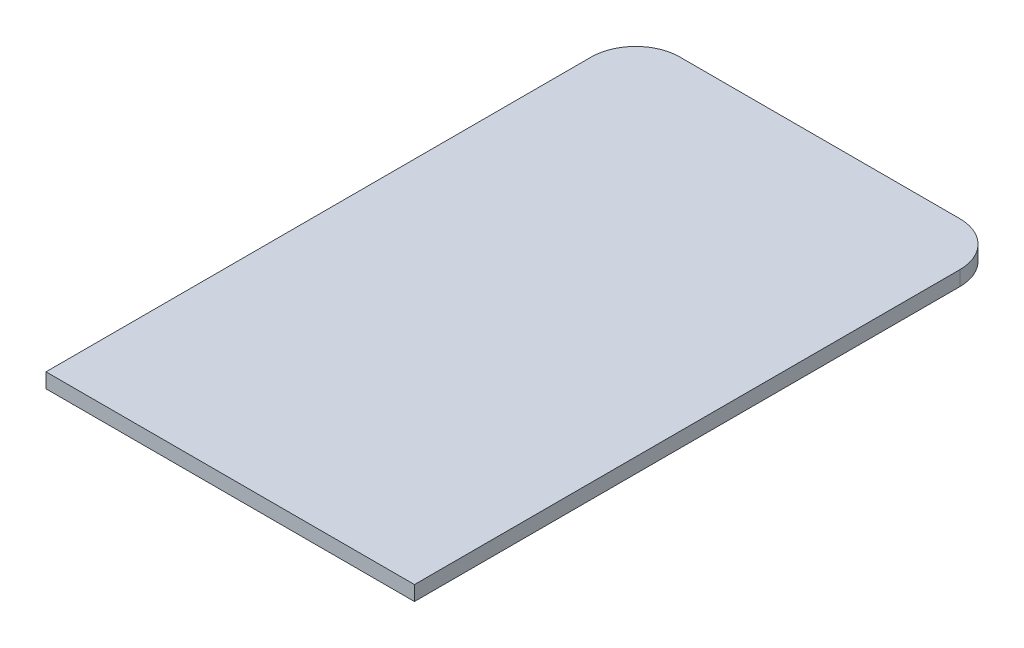
ISO-10303-21;
HEADER;
FILE_DESCRIPTION(('STEP AP214'),'2;1');
FILE_NAME('part.step','',(''),(''),'','','');
FILE_SCHEMA(('AUTOMOTIVE_DESIGN { 1 0 10303 214 1 1 1 1 }'));
ENDSEC;
DATA;
#1=APPLICATION_CONTEXT('core data for automotive mechanical design processes');
#2=APPLICATION_PROTOCOL_DEFINITION('international standard','automotive_design',2000,#1);
#3=PRODUCT_CONTEXT('',#1,'mechanical');
#4=PRODUCT('Part','Part','',(#3));
#5=PRODUCT_RELATED_PRODUCT_CATEGORY('part','',(#4));
#6=PRODUCT_DEFINITION_FORMATION('','',#4);
#7=PRODUCT_DEFINITION_CONTEXT('part definition',#1,'design');
#8=PRODUCT_DEFINITION('design','',#6,#7);
#9=PRODUCT_DEFINITION_SHAPE('','',#8);
#10=(LENGTH_UNIT() NAMED_UNIT(*) SI_UNIT(.MILLI.,.METRE.));
#11=(NAMED_UNIT(*) PLANE_ANGLE_UNIT() SI_UNIT($,.RADIAN.));
#12=(NAMED_UNIT(*) SI_UNIT($,.STERADIAN.) SOLID_ANGLE_UNIT());
#13=UNCERTAINTY_MEASURE_WITH_UNIT(LENGTH_MEASURE(1.E-05),#10,'distance_accuracy_value','');
#14=(GEOMETRIC_REPRESENTATION_CONTEXT(3) GLOBAL_UNCERTAINTY_ASSIGNED_CONTEXT((#13)) GLOBAL_UNIT_ASSIGNED_CONTEXT((#10,
#11,#12)) REPRESENTATION_CONTEXT('',''));
#15=CARTESIAN_POINT('',(0.,0.,0.));
#16=DIRECTION('',(0.,0.,1.));
#17=DIRECTION('',(1.,0.,0.));
#18=AXIS2_PLACEMENT_3D('',#15,#16,#17);
#19=CARTESIAN_POINT('',(0.,0.1,0.));
#20=DIRECTION('',(0.,0.,-1.));
#21=DIRECTION('',(-1.,0.,0.));
#22=AXIS2_PLACEMENT_3D('',#19,#20,#21);
#23=PLANE('',#22);
#24=DIRECTION('',(1.,0.,0.));
#25=VECTOR('',#24,1.);
#26=CARTESIAN_POINT('',(0.,0.,0.));
#27=LINE('',#26,#25);
#28=CARTESIAN_POINT('',(-1.25,0.,0.));
#29=VERTEX_POINT('',#28);
#30=CARTESIAN_POINT('',(1.25,0.,0.));
#31=VERTEX_POINT('',#30);
#32=EDGE_CURVE('E85',#29,#31,#27,.T.);
#33=ORIENTED_EDGE('',*,*,#32,.T.);
#34=DIRECTION('',(0.,-1.,0.));
#35=VECTOR('',#34,1.);
#36=CARTESIAN_POINT('',(1.25,0.1,0.));
#37=LINE('',#36,#35);
#38=CARTESIAN_POINT('',(1.25,0.1,0.));
#39=VERTEX_POINT('',#38);
#40=EDGE_CURVE('E11',#39,#31,#37,.T.);
#41=ORIENTED_EDGE('',*,*,#40,.F.);
#42=DIRECTION('',(1.,0.,0.));
#43=VECTOR('',#42,1.);
#44=CARTESIAN_POINT('',(-1.25,0.1,0.));
#45=LINE('',#44,#43);
#46=CARTESIAN_POINT('',(-1.25,0.1,0.));
#47=VERTEX_POINT('',#46);
#48=EDGE_CURVE('E91',#47,#39,#45,.T.);
#49=ORIENTED_EDGE('',*,*,#48,.F.);
#50=DIRECTION('',(0.,-1.,0.));
#51=VECTOR('',#50,1.);
#52=CARTESIAN_POINT('',(-1.25,0.1,0.));
#53=LINE('',#52,#51);
#54=EDGE_CURVE('E119',#47,#29,#53,.T.);
#55=ORIENTED_EDGE('',*,*,#54,.T.);
#56=EDGE_LOOP('',(#33,#41,#49,#55));
#57=FACE_BOUND('',#56,.T.);
#58=ADVANCED_FACE('F39',(#57),#23,.F.);
#59=CARTESIAN_POINT('',(1.25,0.1,0.));
#60=DIRECTION('',(-1.,0.,0.));
#61=DIRECTION('',(0.,0.,1.));
#62=AXIS2_PLACEMENT_3D('',#59,#60,#61);
#63=PLANE('',#62);
#64=DIRECTION('',(0.,0.,-1.));
#65=VECTOR('',#64,1.);
#66=CARTESIAN_POINT('',(1.25,0.,0.));
#67=LINE('',#66,#65);
#68=CARTESIAN_POINT('',(1.25,0.,-3.7));
#69=VERTEX_POINT('',#68);
#70=EDGE_CURVE('E124',#31,#69,#67,.T.);
#71=ORIENTED_EDGE('',*,*,#70,.T.);
#72=DIRECTION('',(0.,-1.,0.));
#73=VECTOR('',#72,1.);
#74=CARTESIAN_POINT('',(1.25,0.1,-3.7));
#75=LINE('',#74,#73);
#76=CARTESIAN_POINT('',(1.25,0.1,-3.7));
#77=VERTEX_POINT('',#76);
#78=EDGE_CURVE('E47',#77,#69,#75,.T.);
#79=ORIENTED_EDGE('',*,*,#78,.F.);
#80=DIRECTION('',(0.,0.,-1.));
#81=VECTOR('',#80,1.);
#82=CARTESIAN_POINT('',(1.25,0.1,0.));
#83=LINE('',#82,#81);
#84=EDGE_CURVE('E146',#39,#77,#83,.T.);
#85=ORIENTED_EDGE('',*,*,#84,.F.);
#86=ORIENTED_EDGE('',*,*,#40,.T.);
#87=EDGE_LOOP('',(#71,#79,#85,#86));
#88=FACE_BOUND('',#87,.T.);
#89=ADVANCED_FACE('F149',(#88),#63,.F.);
#90=CARTESIAN_POINT('',(0.95,0.1,-3.7));
#91=DIRECTION('',(0.,-1.,0.));
#92=DIRECTION('',(0.,0.,-1.));
#93=AXIS2_PLACEMENT_3D('',#90,#91,#92);
#94=CYLINDRICAL_SURFACE('',#93,0.3);
#95=CARTESIAN_POINT('',(0.95,0.,-3.7));
#96=DIRECTION('',(0.,1.,0.));
#97=DIRECTION('',(0.,0.,1.));
#98=AXIS2_PLACEMENT_3D('',#95,#96,#97);
#99=CIRCLE('',#98,0.3);
#100=CARTESIAN_POINT('',(0.95,0.,-4.));
#101=VERTEX_POINT('',#100);
#102=EDGE_CURVE('E126',#69,#101,#99,.T.);
#103=ORIENTED_EDGE('',*,*,#102,.T.);
#104=DIRECTION('',(0.,-1.,0.));
#105=VECTOR('',#104,1.);
#106=CARTESIAN_POINT('',(0.95,0.1,-4.));
#107=LINE('',#106,#105);
#108=CARTESIAN_POINT('',(0.95,0.1,-4.));
#109=VERTEX_POINT('',#108);
#110=EDGE_CURVE('E114',#109,#101,#107,.T.);
#111=ORIENTED_EDGE('',*,*,#110,.F.);
#112=CARTESIAN_POINT('',(0.95,0.1,-3.7));
#113=DIRECTION('',(0.,1.,0.));
#114=DIRECTION('',(0.,0.,1.));
#115=AXIS2_PLACEMENT_3D('',#112,#113,#114);
#116=CIRCLE('',#115,0.3);
#117=EDGE_CURVE('E105',#77,#109,#116,.T.);
#118=ORIENTED_EDGE('',*,*,#117,.F.);
#119=ORIENTED_EDGE('',*,*,#78,.T.);
#120=EDGE_LOOP('',(#103,#111,#118,#119));
#121=FACE_BOUND('',#120,.T.);
#122=ADVANCED_FACE('F139',(#121),#94,.T.);
#123=CARTESIAN_POINT('',(0.95,0.1,-4.));
#124=DIRECTION('',(0.,0.,1.));
#125=DIRECTION('',(1.,0.,0.));
#126=AXIS2_PLACEMENT_3D('',#123,#124,#125);
#127=PLANE('',#126);
#128=DIRECTION('',(-1.,0.,0.));
#129=VECTOR('',#128,1.);
#130=CARTESIAN_POINT('',(0.95,0.,-4.));
#131=LINE('',#130,#129);
#132=CARTESIAN_POINT('',(-0.950000000000001,0.,-4.));
#133=VERTEX_POINT('',#132);
#134=EDGE_CURVE('E113',#101,#133,#131,.T.);
#135=ORIENTED_EDGE('',*,*,#134,.T.);
#136=DIRECTION('',(0.,-1.,0.));
#137=VECTOR('',#136,1.);
#138=CARTESIAN_POINT('',(-0.950000000000001,0.1,-4.));
#139=LINE('',#138,#137);
#140=CARTESIAN_POINT('',(-0.950000000000001,0.1,-4.));
#141=VERTEX_POINT('',#140);
#142=EDGE_CURVE('E110',#141,#133,#139,.T.);
#143=ORIENTED_EDGE('',*,*,#142,.F.);
#144=DIRECTION('',(-1.,0.,0.));
#145=VECTOR('',#144,1.);
#146=CARTESIAN_POINT('',(0.95,0.1,-4.));
#147=LINE('',#146,#145);
#148=EDGE_CURVE('E99',#109,#141,#147,.T.);
#149=ORIENTED_EDGE('',*,*,#148,.F.);
#150=ORIENTED_EDGE('',*,*,#110,.T.);
#151=EDGE_LOOP('',(#135,#143,#149,#150));
#152=FACE_BOUND('',#151,.T.);
#153=ADVANCED_FACE('F111',(#152),#127,.F.);
#154=CARTESIAN_POINT('',(-0.950000000000001,0.1,-3.7));
#155=DIRECTION('',(0.,-1.,0.));
#156=DIRECTION('',(0.,0.,-1.));
#157=AXIS2_PLACEMENT_3D('',#154,#155,#156);
#158=CYLINDRICAL_SURFACE('',#157,0.299999999999999);
#159=CARTESIAN_POINT('',(-0.950000000000001,0.,-3.7));
#160=DIRECTION('',(0.,1.,0.));
#161=DIRECTION('',(0.,0.,1.));
#162=AXIS2_PLACEMENT_3D('',#159,#160,#161);
#163=CIRCLE('',#162,0.299999999999999);
#164=CARTESIAN_POINT('',(-1.25,0.,-3.7));
#165=VERTEX_POINT('',#164);
#166=EDGE_CURVE('E78',#133,#165,#163,.T.);
#167=ORIENTED_EDGE('',*,*,#166,.T.);
#168=DIRECTION('',(0.,-1.,0.));
#169=VECTOR('',#168,1.);
#170=CARTESIAN_POINT('',(-1.25,0.1,-3.7));
#171=LINE('',#170,#169);
#172=CARTESIAN_POINT('',(-1.25,0.1,-3.7));
#173=VERTEX_POINT('',#172);
#174=EDGE_CURVE('E115',#173,#165,#171,.T.);
#175=ORIENTED_EDGE('',*,*,#174,.F.);
#176=CARTESIAN_POINT('',(-0.950000000000001,0.1,-3.7));
#177=DIRECTION('',(0.,1.,0.));
#178=DIRECTION('',(0.,0.,1.));
#179=AXIS2_PLACEMENT_3D('',#176,#177,#178);
#180=CIRCLE('',#179,0.299999999999999);
#181=EDGE_CURVE('E103',#141,#173,#180,.T.);
#182=ORIENTED_EDGE('',*,*,#181,.F.);
#183=ORIENTED_EDGE('',*,*,#142,.T.);
#184=EDGE_LOOP('',(#167,#175,#182,#183));
#185=FACE_BOUND('',#184,.T.);
#186=ADVANCED_FACE('F117',(#185),#158,.T.);
#187=CARTESIAN_POINT('',(-1.25,0.1,-3.7));
#188=DIRECTION('',(1.,0.,0.));
#189=DIRECTION('',(0.,0.,-1.));
#190=AXIS2_PLACEMENT_3D('',#187,#188,#189);
#191=PLANE('',#190);
#192=DIRECTION('',(0.,0.,1.));
#193=VECTOR('',#192,1.);
#194=CARTESIAN_POINT('',(-1.25,0.,-3.7));
#195=LINE('',#194,#193);
#196=EDGE_CURVE('E130',#165,#29,#195,.T.);
#197=ORIENTED_EDGE('',*,*,#196,.T.);
#198=ORIENTED_EDGE('',*,*,#54,.F.);
#199=DIRECTION('',(0.,0.,1.));
#200=VECTOR('',#199,1.);
#201=CARTESIAN_POINT('',(-1.25,0.1,-3.7));
#202=LINE('',#201,#200);
#203=EDGE_CURVE('E55',#173,#47,#202,.T.);
#204=ORIENTED_EDGE('',*,*,#203,.F.);
#205=ORIENTED_EDGE('',*,*,#174,.T.);
#206=EDGE_LOOP('',(#197,#198,#204,#205));
#207=FACE_BOUND('',#206,.T.);
#208=ADVANCED_FACE('F144',(#207),#191,.F.);
#209=CARTESIAN_POINT('',(0.95,0.1,-3.7));
#210=DIRECTION('',(0.,1.,0.));
#211=DIRECTION('',(0.,0.,1.));
#212=AXIS2_PLACEMENT_3D('',#209,#210,#211);
#213=PLANE('',#212);
#214=ORIENTED_EDGE('',*,*,#48,.T.);
#215=ORIENTED_EDGE('',*,*,#84,.T.);
#216=ORIENTED_EDGE('',*,*,#117,.T.);
#217=ORIENTED_EDGE('',*,*,#148,.T.);
#218=ORIENTED_EDGE('',*,*,#181,.T.);
#219=ORIENTED_EDGE('',*,*,#203,.T.);
#220=EDGE_LOOP('',(#214,#215,#216,#217,#218,#219));
#221=FACE_BOUND('',#220,.T.);
#222=ADVANCED_FACE('F101',(#221),#213,.T.);
#223=CARTESIAN_POINT('',(0.95,0.,-3.7));
#224=DIRECTION('',(0.,1.,0.));
#225=DIRECTION('',(0.,0.,1.));
#226=AXIS2_PLACEMENT_3D('',#223,#224,#225);
#227=PLANE('',#226);
#228=ORIENTED_EDGE('',*,*,#32,.F.);
#229=ORIENTED_EDGE('',*,*,#196,.F.);
#230=ORIENTED_EDGE('',*,*,#166,.F.);
#231=ORIENTED_EDGE('',*,*,#134,.F.);
#232=ORIENTED_EDGE('',*,*,#102,.F.);
#233=ORIENTED_EDGE('',*,*,#70,.F.);
#234=EDGE_LOOP('',(#228,#229,#230,#231,#232,#233));
#235=FACE_BOUND('',#234,.T.);
#236=ADVANCED_FACE('F142',(#235),#227,.F.);
#237=CLOSED_SHELL('',(#58,#89,#122,#153,#186,#208,#222,#236));
#238=MANIFOLD_SOLID_BREP('B2',#237);
#239=ADVANCED_BREP_SHAPE_REPRESENTATION('',(#18,#238),#14);
#240=SHAPE_DEFINITION_REPRESENTATION(#9,#239);
ENDSEC;
END-ISO-10303-21;
